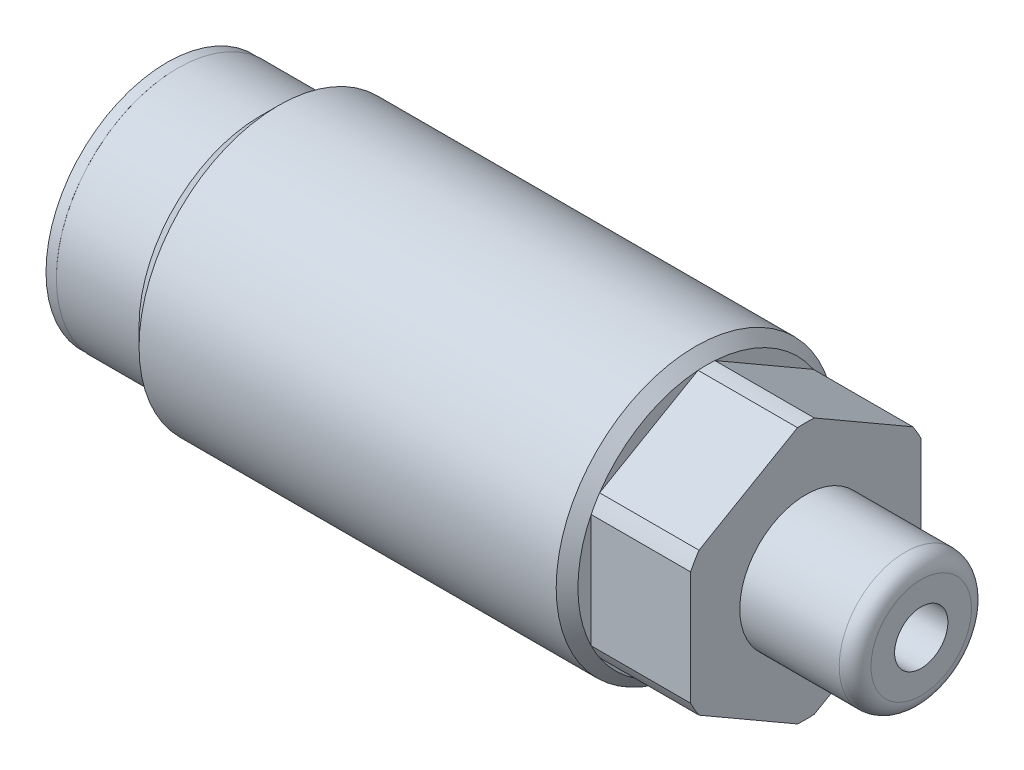
ISO-10303-21;
HEADER;
FILE_DESCRIPTION(('STEP AP214'),'2;1');
FILE_NAME('part.step','',(''),(''),'','','');
FILE_SCHEMA(('AUTOMOTIVE_DESIGN { 1 0 10303 214 1 1 1 1 }'));
ENDSEC;
DATA;
#1=APPLICATION_CONTEXT('core data for automotive mechanical design processes');
#2=APPLICATION_PROTOCOL_DEFINITION('international standard','automotive_design',2000,#1);
#3=PRODUCT_CONTEXT('',#1,'mechanical');
#4=PRODUCT('Part','Part','',(#3));
#5=PRODUCT_RELATED_PRODUCT_CATEGORY('part','',(#4));
#6=PRODUCT_DEFINITION_FORMATION('','',#4);
#7=PRODUCT_DEFINITION_CONTEXT('part definition',#1,'design');
#8=PRODUCT_DEFINITION('design','',#6,#7);
#9=PRODUCT_DEFINITION_SHAPE('','',#8);
#10=(LENGTH_UNIT() NAMED_UNIT(*) SI_UNIT(.MILLI.,.METRE.));
#11=(NAMED_UNIT(*) PLANE_ANGLE_UNIT() SI_UNIT($,.RADIAN.));
#12=(NAMED_UNIT(*) SI_UNIT($,.STERADIAN.) SOLID_ANGLE_UNIT());
#13=UNCERTAINTY_MEASURE_WITH_UNIT(LENGTH_MEASURE(1.E-05),#10,'distance_accuracy_value','');
#14=(GEOMETRIC_REPRESENTATION_CONTEXT(3) GLOBAL_UNCERTAINTY_ASSIGNED_CONTEXT((#13)) GLOBAL_UNIT_ASSIGNED_CONTEXT((#10,
#11,#12)) REPRESENTATION_CONTEXT('',''));
#15=CARTESIAN_POINT('',(0.,0.,0.));
#16=DIRECTION('',(0.,0.,1.));
#17=DIRECTION('',(1.,0.,0.));
#18=AXIS2_PLACEMENT_3D('',#15,#16,#17);
#19=CARTESIAN_POINT('',(71.247,0.,0.));
#20=DIRECTION('',(-1.,0.,0.));
#21=DIRECTION('',(0.,-1.,0.));
#22=AXIS2_PLACEMENT_3D('',#19,#20,#21);
#23=PLANE('',#22);
#24=CARTESIAN_POINT('',(71.247,0.,0.));
#25=DIRECTION('',(-1.,0.,0.));
#26=DIRECTION('',(0.,-1.,0.));
#27=AXIS2_PLACEMENT_3D('',#24,#25,#26);
#28=CIRCLE('',#27,4.8133);
#29=CARTESIAN_POINT('',(71.247,-4.8133,0.));
#30=VERTEX_POINT('',#29);
#31=EDGE_CURVE('E12',#30,#30,#28,.F.);
#32=ORIENTED_EDGE('',*,*,#31,.T.);
#33=EDGE_LOOP('',(#32));
#34=FACE_BOUND('',#33,.T.);
#35=CARTESIAN_POINT('',(71.247,0.,0.));
#36=DIRECTION('',(-1.,0.,0.));
#37=DIRECTION('',(0.,0.,1.));
#38=AXIS2_PLACEMENT_3D('',#35,#36,#37);
#39=CIRCLE('',#38,2.5527);
#40=CARTESIAN_POINT('',(71.247,0.,2.5527));
#41=VERTEX_POINT('',#40);
#42=EDGE_CURVE('E141',#41,#41,#39,.T.);
#43=ORIENTED_EDGE('',*,*,#42,.T.);
#44=EDGE_LOOP('',(#43));
#45=FACE_BOUND('',#44,.T.);
#46=ADVANCED_FACE('F41',(#34,#45),#23,.F.);
#47=CARTESIAN_POINT('',(50.673,13.3604,0.));
#48=DIRECTION('',(1.,0.,0.));
#49=DIRECTION('',(0.,0.,-1.));
#50=AXIS2_PLACEMENT_3D('',#47,#48,#49);
#51=PLANE('',#50);
#52=DIRECTION('',(0.,-0.5,-0.866025403784439));
#53=VECTOR('',#52,1.);
#54=CARTESIAN_POINT('',(50.673,-6.37914312427618,11.049));
#55=LINE('',#54,#53);
#56=CARTESIAN_POINT('',(50.673,-6.84486814154431,10.2423406077357));
#57=VERTEX_POINT('',#56);
#58=CARTESIAN_POINT('',(50.673,-12.2925612312842,0.806659392264294));
#59=VERTEX_POINT('',#58);
#60=EDGE_CURVE('E221',#57,#59,#55,.T.);
#61=ORIENTED_EDGE('',*,*,#60,.F.);
#62=CARTESIAN_POINT('',(50.673,0.,0.));
#63=DIRECTION('',(1.,0.,0.));
#64=DIRECTION('',(0.,0.,-1.));
#65=AXIS2_PLACEMENT_3D('',#62,#63,#64);
#66=CIRCLE('',#65,12.319);
#67=EDGE_CURVE('E250',#57,#59,#66,.T.);
#68=ORIENTED_EDGE('',*,*,#67,.T.);
#69=EDGE_LOOP('',(#61,#68));
#70=FACE_BOUND('',#69,.T.);
#71=ADVANCED_FACE('F269',(#70),#51,.T.);
#72=DIRECTION('',(0.,0.5,-0.866025403784439));
#73=VECTOR('',#72,1.);
#74=CARTESIAN_POINT('',(50.673,-12.7582862485524,0.));
#75=LINE('',#74,#73);
#76=CARTESIAN_POINT('',(50.673,-12.2925612312842,-0.806659392264294));
#77=VERTEX_POINT('',#76);
#78=CARTESIAN_POINT('',(50.673,-6.84486814154431,-10.2423406077357));
#79=VERTEX_POINT('',#78);
#80=EDGE_CURVE('E194',#77,#79,#75,.T.);
#81=ORIENTED_EDGE('',*,*,#80,.F.);
#82=CARTESIAN_POINT('',(50.673,0.,0.));
#83=DIRECTION('',(1.,0.,0.));
#84=DIRECTION('',(0.,0.,-1.));
#85=AXIS2_PLACEMENT_3D('',#82,#83,#84);
#86=CIRCLE('',#85,12.319);
#87=EDGE_CURVE('E55',#77,#79,#86,.T.);
#88=ORIENTED_EDGE('',*,*,#87,.T.);
#89=EDGE_LOOP('',(#81,#88));
#90=FACE_BOUND('',#89,.T.);
#91=ADVANCED_FACE('F275',(#90),#51,.T.);
#92=DIRECTION('',(0.,1.,0.));
#93=VECTOR('',#92,1.);
#94=CARTESIAN_POINT('',(50.673,-6.37914312427618,-11.049));
#95=LINE('',#94,#93);
#96=CARTESIAN_POINT('',(50.673,-5.44769308973991,-11.049));
#97=VERTEX_POINT('',#96);
#98=CARTESIAN_POINT('',(50.673,5.44769308973991,-11.049));
#99=VERTEX_POINT('',#98);
#100=EDGE_CURVE('E189',#97,#99,#95,.T.);
#101=ORIENTED_EDGE('',*,*,#100,.F.);
#102=CARTESIAN_POINT('',(50.673,0.,0.));
#103=DIRECTION('',(1.,0.,0.));
#104=DIRECTION('',(0.,0.,-1.));
#105=AXIS2_PLACEMENT_3D('',#102,#103,#104);
#106=CIRCLE('',#105,12.319);
#107=EDGE_CURVE('E247',#97,#99,#106,.T.);
#108=ORIENTED_EDGE('',*,*,#107,.T.);
#109=EDGE_LOOP('',(#101,#108));
#110=FACE_BOUND('',#109,.T.);
#111=ADVANCED_FACE('F460',(#110),#51,.T.);
#112=DIRECTION('',(0.,0.5,0.866025403784439));
#113=VECTOR('',#112,1.);
#114=CARTESIAN_POINT('',(50.673,6.37914312427617,-11.049));
#115=LINE('',#114,#113);
#116=CARTESIAN_POINT('',(50.673,6.8448681415443,-10.2423406077357));
#117=VERTEX_POINT('',#116);
#118=CARTESIAN_POINT('',(50.673,12.2925612312842,-0.806659392264296));
#119=VERTEX_POINT('',#118);
#120=EDGE_CURVE('E212',#117,#119,#115,.T.);
#121=ORIENTED_EDGE('',*,*,#120,.F.);
#122=CARTESIAN_POINT('',(50.673,0.,0.));
#123=DIRECTION('',(1.,0.,0.));
#124=DIRECTION('',(0.,0.,-1.));
#125=AXIS2_PLACEMENT_3D('',#122,#123,#124);
#126=CIRCLE('',#125,12.319);
#127=EDGE_CURVE('E245',#117,#119,#126,.T.);
#128=ORIENTED_EDGE('',*,*,#127,.T.);
#129=EDGE_LOOP('',(#121,#128));
#130=FACE_BOUND('',#129,.T.);
#131=ADVANCED_FACE('F469',(#130),#51,.T.);
#132=DIRECTION('',(0.,-0.5,0.866025403784439));
#133=VECTOR('',#132,1.);
#134=CARTESIAN_POINT('',(50.673,12.7582862485523,0.));
#135=LINE('',#134,#133);
#136=CARTESIAN_POINT('',(50.673,12.2925612312842,0.806659392264289));
#137=VERTEX_POINT('',#136);
#138=CARTESIAN_POINT('',(50.673,6.84486814154431,10.2423406077357));
#139=VERTEX_POINT('',#138);
#140=EDGE_CURVE('E215',#137,#139,#135,.T.);
#141=ORIENTED_EDGE('',*,*,#140,.F.);
#142=CARTESIAN_POINT('',(50.673,0.,0.));
#143=DIRECTION('',(1.,0.,0.));
#144=DIRECTION('',(0.,0.,-1.));
#145=AXIS2_PLACEMENT_3D('',#142,#143,#144);
#146=CIRCLE('',#145,12.319);
#147=EDGE_CURVE('E243',#137,#139,#146,.T.);
#148=ORIENTED_EDGE('',*,*,#147,.T.);
#149=EDGE_LOOP('',(#141,#148));
#150=FACE_BOUND('',#149,.T.);
#151=ADVANCED_FACE('F291',(#150),#51,.T.);
#152=CARTESIAN_POINT('',(60.198,19.1374293728285,-11.049));
#153=DIRECTION('',(1.,0.,0.));
#154=DIRECTION('',(0.,0.,-1.));
#155=AXIS2_PLACEMENT_3D('',#152,#153,#154);
#156=PLANE('',#155);
#157=CARTESIAN_POINT('',(60.198,0.,0.));
#158=DIRECTION('',(-1.,0.,0.));
#159=DIRECTION('',(0.,-1.,0.));
#160=AXIS2_PLACEMENT_3D('',#157,#158,#159);
#161=CIRCLE('',#160,6.3373);
#162=CARTESIAN_POINT('',(60.198,-6.3373,0.));
#163=VERTEX_POINT('',#162);
#164=EDGE_CURVE('E186',#163,#163,#161,.T.);
#165=ORIENTED_EDGE('',*,*,#164,.T.);
#166=EDGE_LOOP('',(#165));
#167=FACE_BOUND('',#166,.T.);
#168=DIRECTION('',(0.,1.,0.));
#169=VECTOR('',#168,1.);
#170=CARTESIAN_POINT('',(60.198,-6.37914312427618,-11.049));
#171=LINE('',#170,#169);
#172=CARTESIAN_POINT('',(60.198,-5.44769308973992,-11.049));
#173=VERTEX_POINT('',#172);
#174=CARTESIAN_POINT('',(60.198,5.44769308973992,-11.049));
#175=VERTEX_POINT('',#174);
#176=EDGE_CURVE('E190',#173,#175,#171,.T.);
#177=ORIENTED_EDGE('',*,*,#176,.T.);
#178=CARTESIAN_POINT('',(60.198,0.,0.));
#179=DIRECTION('',(1.,0.,0.));
#180=DIRECTION('',(0.,0.,-1.));
#181=AXIS2_PLACEMENT_3D('',#178,#179,#180);
#182=CIRCLE('',#181,12.319);
#183=CARTESIAN_POINT('',(60.198,6.8448681415443,-10.2423406077357));
#184=VERTEX_POINT('',#183);
#185=EDGE_CURVE('E147',#175,#184,#182,.T.);
#186=ORIENTED_EDGE('',*,*,#185,.T.);
#187=DIRECTION('',(0.,0.5,0.866025403784439));
#188=VECTOR('',#187,1.);
#189=CARTESIAN_POINT('',(60.198,6.37914312427617,-11.049));
#190=LINE('',#189,#188);
#191=CARTESIAN_POINT('',(60.198,12.2925612312842,-0.806659392264294));
#192=VERTEX_POINT('',#191);
#193=EDGE_CURVE('E193',#184,#192,#190,.T.);
#194=ORIENTED_EDGE('',*,*,#193,.T.);
#195=CARTESIAN_POINT('',(60.198,12.2925612312842,0.806659392264289));
#196=VERTEX_POINT('',#195);
#197=EDGE_CURVE('E151',#192,#196,#182,.T.);
#198=ORIENTED_EDGE('',*,*,#197,.T.);
#199=DIRECTION('',(0.,-0.5,0.866025403784439));
#200=VECTOR('',#199,1.);
#201=CARTESIAN_POINT('',(60.198,12.7582862485523,0.));
#202=LINE('',#201,#200);
#203=CARTESIAN_POINT('',(60.198,6.84486814154431,10.2423406077357));
#204=VERTEX_POINT('',#203);
#205=EDGE_CURVE('E197',#196,#204,#202,.T.);
#206=ORIENTED_EDGE('',*,*,#205,.T.);
#207=CARTESIAN_POINT('',(60.198,5.44769308973992,11.049));
#208=VERTEX_POINT('',#207);
#209=EDGE_CURVE('E599',#204,#208,#182,.T.);
#210=ORIENTED_EDGE('',*,*,#209,.T.);
#211=DIRECTION('',(0.,-1.,0.));
#212=VECTOR('',#211,1.);
#213=CARTESIAN_POINT('',(60.198,6.37914312427618,11.049));
#214=LINE('',#213,#212);
#215=CARTESIAN_POINT('',(60.198,-5.44769308973992,11.049));
#216=VERTEX_POINT('',#215);
#217=EDGE_CURVE('E200',#208,#216,#214,.T.);
#218=ORIENTED_EDGE('',*,*,#217,.T.);
#219=CARTESIAN_POINT('',(60.198,-6.84486814154431,10.2423406077357));
#220=VERTEX_POINT('',#219);
#221=EDGE_CURVE('E597',#216,#220,#182,.T.);
#222=ORIENTED_EDGE('',*,*,#221,.T.);
#223=DIRECTION('',(0.,-0.5,-0.866025403784439));
#224=VECTOR('',#223,1.);
#225=CARTESIAN_POINT('',(60.198,-6.37914312427618,11.049));
#226=LINE('',#225,#224);
#227=CARTESIAN_POINT('',(60.198,-12.2925612312842,0.806659392264292));
#228=VERTEX_POINT('',#227);
#229=EDGE_CURVE('E203',#220,#228,#226,.T.);
#230=ORIENTED_EDGE('',*,*,#229,.T.);
#231=CARTESIAN_POINT('',(60.198,-12.2925612312842,-0.806659392264291));
#232=VERTEX_POINT('',#231);
#233=EDGE_CURVE('E596',#228,#232,#182,.T.);
#234=ORIENTED_EDGE('',*,*,#233,.T.);
#235=DIRECTION('',(0.,0.5,-0.866025403784439));
#236=VECTOR('',#235,1.);
#237=CARTESIAN_POINT('',(60.198,-12.7582862485524,0.));
#238=LINE('',#237,#236);
#239=CARTESIAN_POINT('',(60.198,-6.84486814154431,-10.2423406077357));
#240=VERTEX_POINT('',#239);
#241=EDGE_CURVE('E206',#232,#240,#238,.T.);
#242=ORIENTED_EDGE('',*,*,#241,.T.);
#243=EDGE_CURVE('E144',#240,#173,#182,.T.);
#244=ORIENTED_EDGE('',*,*,#243,.T.);
#245=EDGE_LOOP('',(#177,#186,#194,#198,#206,#210,#218,#222,#230,#234,#242,#244));
#246=FACE_BOUND('',#245,.T.);
#247=ADVANCED_FACE('F287',(#167,#246),#156,.T.);
#248=CARTESIAN_POINT('',(60.198,-6.37914312427618,-11.049));
#249=DIRECTION('',(0.,0.,1.));
#250=DIRECTION('',(1.,0.,0.));
#251=AXIS2_PLACEMENT_3D('',#248,#249,#250);
#252=PLANE('',#251);
#253=DIRECTION('',(1.,0.,0.));
#254=VECTOR('',#253,1.);
#255=CARTESIAN_POINT('',(12.884082242541,-5.44769308973992,-11.049));
#256=LINE('',#255,#254);
#257=EDGE_CURVE('E63',#97,#173,#256,.T.);
#258=ORIENTED_EDGE('',*,*,#257,.F.);
#259=ORIENTED_EDGE('',*,*,#100,.T.);
#260=DIRECTION('',(1.,0.,0.));
#261=VECTOR('',#260,1.);
#262=CARTESIAN_POINT('',(12.884082242541,5.44769308973992,-11.049));
#263=LINE('',#262,#261);
#264=EDGE_CURVE('E176',#175,#99,#263,.F.);
#265=ORIENTED_EDGE('',*,*,#264,.F.);
#266=ORIENTED_EDGE('',*,*,#176,.F.);
#267=EDGE_LOOP('',(#258,#259,#265,#266));
#268=FACE_BOUND('',#267,.T.);
#269=ADVANCED_FACE('F290',(#268),#252,.F.);
#270=CARTESIAN_POINT('',(60.198,6.37914312427617,-11.049));
#271=DIRECTION('',(0.,-0.866025403784439,0.5));
#272=DIRECTION('',(0.,-0.5,-0.866025403784439));
#273=AXIS2_PLACEMENT_3D('',#270,#271,#272);
#274=PLANE('',#273);
#275=DIRECTION('',(1.,0.,0.));
#276=VECTOR('',#275,1.);
#277=CARTESIAN_POINT('',(12.884082242541,6.8448681415443,-10.2423406077357));
#278=LINE('',#277,#276);
#279=EDGE_CURVE('E174',#117,#184,#278,.T.);
#280=ORIENTED_EDGE('',*,*,#279,.F.);
#281=ORIENTED_EDGE('',*,*,#120,.T.);
#282=DIRECTION('',(1.,0.,0.));
#283=VECTOR('',#282,1.);
#284=CARTESIAN_POINT('',(12.884082242541,12.2925612312842,-0.806659392264294));
#285=LINE('',#284,#283);
#286=EDGE_CURVE('E171',#192,#119,#285,.F.);
#287=ORIENTED_EDGE('',*,*,#286,.F.);
#288=ORIENTED_EDGE('',*,*,#193,.F.);
#289=EDGE_LOOP('',(#280,#281,#287,#288));
#290=FACE_BOUND('',#289,.T.);
#291=ADVANCED_FACE('F308',(#290),#274,.F.);
#292=CARTESIAN_POINT('',(60.198,12.7582862485523,0.));
#293=DIRECTION('',(0.,-0.866025403784439,-0.5));
#294=DIRECTION('',(0.,0.5,-0.866025403784439));
#295=AXIS2_PLACEMENT_3D('',#292,#293,#294);
#296=PLANE('',#295);
#297=DIRECTION('',(1.,0.,0.));
#298=VECTOR('',#297,1.);
#299=CARTESIAN_POINT('',(12.884082242541,12.2925612312842,0.806659392264289));
#300=LINE('',#299,#298);
#301=EDGE_CURVE('E169',#137,#196,#300,.T.);
#302=ORIENTED_EDGE('',*,*,#301,.F.);
#303=ORIENTED_EDGE('',*,*,#140,.T.);
#304=DIRECTION('',(1.,0.,0.));
#305=VECTOR('',#304,1.);
#306=CARTESIAN_POINT('',(12.884082242541,6.84486814154431,10.2423406077357));
#307=LINE('',#306,#305);
#308=EDGE_CURVE('E166',#204,#139,#307,.F.);
#309=ORIENTED_EDGE('',*,*,#308,.F.);
#310=ORIENTED_EDGE('',*,*,#205,.F.);
#311=EDGE_LOOP('',(#302,#303,#309,#310));
#312=FACE_BOUND('',#311,.T.);
#313=ADVANCED_FACE('F304',(#312),#296,.F.);
#314=CARTESIAN_POINT('',(60.198,6.37914312427618,11.049));
#315=DIRECTION('',(0.,0.,-1.));
#316=DIRECTION('',(-1.,0.,0.));
#317=AXIS2_PLACEMENT_3D('',#314,#315,#316);
#318=PLANE('',#317);
#319=DIRECTION('',(1.,0.,0.));
#320=VECTOR('',#319,1.);
#321=CARTESIAN_POINT('',(12.884082242541,5.44769308973992,11.049));
#322=LINE('',#321,#320);
#323=CARTESIAN_POINT('',(50.673,5.44769308973991,11.049));
#324=VERTEX_POINT('',#323);
#325=EDGE_CURVE('E164',#324,#208,#322,.T.);
#326=ORIENTED_EDGE('',*,*,#325,.F.);
#327=DIRECTION('',(0.,-1.,0.));
#328=VECTOR('',#327,1.);
#329=CARTESIAN_POINT('',(50.673,6.37914312427618,11.049));
#330=LINE('',#329,#328);
#331=CARTESIAN_POINT('',(50.673,-5.44769308973991,11.049));
#332=VERTEX_POINT('',#331);
#333=EDGE_CURVE('E218',#324,#332,#330,.T.);
#334=ORIENTED_EDGE('',*,*,#333,.T.);
#335=DIRECTION('',(1.,0.,0.));
#336=VECTOR('',#335,1.);
#337=CARTESIAN_POINT('',(12.884082242541,-5.44769308973992,11.049));
#338=LINE('',#337,#336);
#339=EDGE_CURVE('E161',#216,#332,#338,.F.);
#340=ORIENTED_EDGE('',*,*,#339,.F.);
#341=ORIENTED_EDGE('',*,*,#217,.F.);
#342=EDGE_LOOP('',(#326,#334,#340,#341));
#343=FACE_BOUND('',#342,.T.);
#344=ADVANCED_FACE('F300',(#343),#318,.F.);
#345=CARTESIAN_POINT('',(60.198,-6.37914312427618,11.049));
#346=DIRECTION('',(0.,0.866025403784439,-0.5));
#347=DIRECTION('',(0.,0.5,0.866025403784439));
#348=AXIS2_PLACEMENT_3D('',#345,#346,#347);
#349=PLANE('',#348);
#350=DIRECTION('',(1.,0.,0.));
#351=VECTOR('',#350,1.);
#352=CARTESIAN_POINT('',(12.884082242541,-6.8448681415443,10.2423406077357));
#353=LINE('',#352,#351);
#354=EDGE_CURVE('E159',#57,#220,#353,.T.);
#355=ORIENTED_EDGE('',*,*,#354,.F.);
#356=ORIENTED_EDGE('',*,*,#60,.T.);
#357=DIRECTION('',(1.,0.,0.));
#358=VECTOR('',#357,1.);
#359=CARTESIAN_POINT('',(12.884082242541,-12.2925612312842,0.806659392264292));
#360=LINE('',#359,#358);
#361=EDGE_CURVE('E155',#228,#59,#360,.F.);
#362=ORIENTED_EDGE('',*,*,#361,.F.);
#363=ORIENTED_EDGE('',*,*,#229,.F.);
#364=EDGE_LOOP('',(#355,#356,#362,#363));
#365=FACE_BOUND('',#364,.T.);
#366=ADVANCED_FACE('F296',(#365),#349,.F.);
#367=CARTESIAN_POINT('',(60.198,-12.7582862485524,0.));
#368=DIRECTION('',(0.,0.866025403784439,0.5));
#369=DIRECTION('',(0.,-0.5,0.866025403784439));
#370=AXIS2_PLACEMENT_3D('',#367,#368,#369);
#371=PLANE('',#370);
#372=DIRECTION('',(1.,0.,0.));
#373=VECTOR('',#372,1.);
#374=CARTESIAN_POINT('',(12.884082242541,-12.2925612312842,-0.806659392264291));
#375=LINE('',#374,#373);
#376=EDGE_CURVE('E236',#77,#232,#375,.T.);
#377=ORIENTED_EDGE('',*,*,#376,.F.);
#378=ORIENTED_EDGE('',*,*,#80,.T.);
#379=DIRECTION('',(1.,0.,0.));
#380=VECTOR('',#379,1.);
#381=CARTESIAN_POINT('',(12.884082242541,-6.84486814154431,-10.2423406077357));
#382=LINE('',#381,#380);
#383=EDGE_CURVE('E234',#240,#79,#382,.F.);
#384=ORIENTED_EDGE('',*,*,#383,.F.);
#385=ORIENTED_EDGE('',*,*,#241,.F.);
#386=EDGE_LOOP('',(#377,#378,#384,#385));
#387=FACE_BOUND('',#386,.T.);
#388=ADVANCED_FACE('F293',(#387),#371,.F.);
#389=ORIENTED_EDGE('',*,*,#333,.F.);
#390=CARTESIAN_POINT('',(50.673,0.,0.));
#391=DIRECTION('',(1.,0.,0.));
#392=DIRECTION('',(0.,0.,-1.));
#393=AXIS2_PLACEMENT_3D('',#390,#391,#392);
#394=CIRCLE('',#393,12.319);
#395=EDGE_CURVE('E241',#324,#332,#394,.T.);
#396=ORIENTED_EDGE('',*,*,#395,.T.);
#397=EDGE_LOOP('',(#389,#396));
#398=FACE_BOUND('',#397,.T.);
#399=ADVANCED_FACE('F278',(#398),#51,.T.);
#400=CARTESIAN_POINT('',(30.6025425410263,0.,0.));
#401=DIRECTION('',(-1.,0.,0.));
#402=DIRECTION('',(0.,0.,1.));
#403=AXIS2_PLACEMENT_3D('',#400,#401,#402);
#404=CYLINDRICAL_SURFACE('',#403,13.3604);
#405=CARTESIAN_POINT('',(49.6316,0.,0.));
#406=DIRECTION('',(1.,0.,0.));
#407=DIRECTION('',(0.,0.,-1.));
#408=AXIS2_PLACEMENT_3D('',#405,#406,#407);
#409=CIRCLE('',#408,13.3604);
#410=CARTESIAN_POINT('',(49.6316,0.,-13.3604));
#411=VERTEX_POINT('',#410);
#412=EDGE_CURVE('E238',#411,#411,#409,.F.);
#413=ORIENTED_EDGE('',*,*,#412,.T.);
#414=EDGE_LOOP('',(#413));
#415=FACE_BOUND('',#414,.T.);
#416=CARTESIAN_POINT('',(9.66469999999998,0.,0.));
#417=DIRECTION('',(-1.,0.,0.));
#418=DIRECTION('',(0.,0.,1.));
#419=AXIS2_PLACEMENT_3D('',#416,#417,#418);
#420=CIRCLE('',#419,13.3604);
#421=CARTESIAN_POINT('',(9.66469999999998,0.,13.3604));
#422=VERTEX_POINT('',#421);
#423=EDGE_CURVE('E209',#422,#422,#420,.T.);
#424=ORIENTED_EDGE('',*,*,#423,.F.);
#425=EDGE_LOOP('',(#424));
#426=FACE_BOUND('',#425,.T.);
#427=ADVANCED_FACE('F325',(#415,#426),#404,.T.);
#428=CARTESIAN_POINT('',(0.,0.,0.));
#429=DIRECTION('',(-1.,0.,0.));
#430=DIRECTION('',(0.,0.,1.));
#431=AXIS2_PLACEMENT_3D('',#428,#429,#430);
#432=PLANE('',#431);
#433=CARTESIAN_POINT('',(0.,0.,0.));
#434=DIRECTION('',(-1.,0.,0.));
#435=DIRECTION('',(0.,0.,1.));
#436=AXIS2_PLACEMENT_3D('',#433,#434,#435);
#437=CIRCLE('',#436,6.73100000000001);
#438=CARTESIAN_POINT('',(0.,0.,6.73100000000001));
#439=VERTEX_POINT('',#438);
#440=EDGE_CURVE('E180',#439,#439,#437,.T.);
#441=ORIENTED_EDGE('',*,*,#440,.F.);
#442=EDGE_LOOP('',(#441));
#443=FACE_BOUND('',#442,.T.);
#444=CARTESIAN_POINT('',(0.,0.,0.));
#445=DIRECTION('',(-1.,0.,0.));
#446=DIRECTION('',(0.,0.,1.));
#447=AXIS2_PLACEMENT_3D('',#444,#445,#446);
#448=CIRCLE('',#447,11.6205);
#449=CARTESIAN_POINT('',(0.,0.,11.6205));
#450=VERTEX_POINT('',#449);
#451=EDGE_CURVE('E231',#450,#450,#448,.T.);
#452=ORIENTED_EDGE('',*,*,#451,.T.);
#453=EDGE_LOOP('',(#452));
#454=FACE_BOUND('',#453,.T.);
#455=ADVANCED_FACE('F322',(#443,#454),#432,.T.);
#456=CARTESIAN_POINT('',(30.6025425410263,0.,0.));
#457=DIRECTION('',(-1.,0.,0.));
#458=DIRECTION('',(0.,0.,1.));
#459=AXIS2_PLACEMENT_3D('',#456,#457,#458);
#460=CYLINDRICAL_SURFACE('',#459,11.6205);
#461=CARTESIAN_POINT('',(7.9248,0.,0.));
#462=DIRECTION('',(-1.,0.,0.));
#463=DIRECTION('',(0.,0.,1.));
#464=AXIS2_PLACEMENT_3D('',#461,#462,#463);
#465=CIRCLE('',#464,11.6205);
#466=CARTESIAN_POINT('',(7.9248,0.,11.6205));
#467=VERTEX_POINT('',#466);
#468=EDGE_CURVE('E228',#467,#467,#465,.T.);
#469=ORIENTED_EDGE('',*,*,#468,.T.);
#470=EDGE_LOOP('',(#469));
#471=FACE_BOUND('',#470,.T.);
#472=ORIENTED_EDGE('',*,*,#451,.F.);
#473=EDGE_LOOP('',(#472));
#474=FACE_BOUND('',#473,.T.);
#475=ADVANCED_FACE('F318',(#471,#474),#460,.T.);
#476=CARTESIAN_POINT('',(7.9248,0.,0.));
#477=DIRECTION('',(1.,0.,0.));
#478=DIRECTION('',(0.,0.,-1.));
#479=AXIS2_PLACEMENT_3D('',#476,#477,#478);
#480=CONICAL_SURFACE('',#479,11.6205,0.785398163397452);
#481=ORIENTED_EDGE('',*,*,#423,.T.);
#482=EDGE_LOOP('',(#481));
#483=FACE_BOUND('',#482,.T.);
#484=ORIENTED_EDGE('',*,*,#468,.F.);
#485=EDGE_LOOP('',(#484));
#486=FACE_BOUND('',#485,.T.);
#487=ADVANCED_FACE('F286',(#483,#486),#480,.T.);
#488=CARTESIAN_POINT('',(60.198,0.,0.));
#489=DIRECTION('',(-1.,0.,0.));
#490=DIRECTION('',(0.,-1.,0.));
#491=AXIS2_PLACEMENT_3D('',#488,#489,#490);
#492=CYLINDRICAL_SURFACE('',#491,6.3373);
#493=CARTESIAN_POINT('',(69.723,0.,0.));
#494=DIRECTION('',(-1.,0.,0.));
#495=DIRECTION('',(0.,-1.,0.));
#496=AXIS2_PLACEMENT_3D('',#493,#494,#495);
#497=CIRCLE('',#496,6.3373);
#498=CARTESIAN_POINT('',(69.723,-6.3373,0.));
#499=VERTEX_POINT('',#498);
#500=EDGE_CURVE('E49',#499,#499,#497,.T.);
#501=ORIENTED_EDGE('',*,*,#500,.T.);
#502=EDGE_LOOP('',(#501));
#503=FACE_BOUND('',#502,.T.);
#504=ORIENTED_EDGE('',*,*,#164,.F.);
#505=EDGE_LOOP('',(#504));
#506=FACE_BOUND('',#505,.T.);
#507=ADVANCED_FACE('F254',(#503,#506),#492,.T.);
#508=CARTESIAN_POINT('',(1.016,0.,0.));
#509=DIRECTION('',(1.,0.,0.));
#510=DIRECTION('',(0.,0.,-1.));
#511=AXIS2_PLACEMENT_3D('',#508,#509,#510);
#512=PLANE('',#511);
#513=CARTESIAN_POINT('',(1.016,0.,0.));
#514=DIRECTION('',(-1.,0.,0.));
#515=DIRECTION('',(0.,0.,1.));
#516=AXIS2_PLACEMENT_3D('',#513,#514,#515);
#517=CIRCLE('',#516,6.73100000000001);
#518=CARTESIAN_POINT('',(1.016,0.,6.73100000000001));
#519=VERTEX_POINT('',#518);
#520=EDGE_CURVE('E183',#519,#519,#517,.T.);
#521=ORIENTED_EDGE('',*,*,#520,.T.);
#522=EDGE_LOOP('',(#521));
#523=FACE_BOUND('',#522,.T.);
#524=ADVANCED_FACE('F282',(#523),#512,.F.);
#525=CARTESIAN_POINT('',(0.,0.,0.));
#526=DIRECTION('',(-1.,0.,0.));
#527=DIRECTION('',(0.,0.,1.));
#528=AXIS2_PLACEMENT_3D('',#525,#526,#527);
#529=CYLINDRICAL_SURFACE('',#528,6.73100000000001);
#530=ORIENTED_EDGE('',*,*,#520,.F.);
#531=EDGE_LOOP('',(#530));
#532=FACE_BOUND('',#531,.T.);
#533=ORIENTED_EDGE('',*,*,#440,.T.);
#534=EDGE_LOOP('',(#533));
#535=FACE_BOUND('',#534,.T.);
#536=ADVANCED_FACE('F369',(#532,#535),#529,.F.);
#537=CARTESIAN_POINT('',(12.884082242541,0.,0.));
#538=DIRECTION('',(1.,0.,0.));
#539=DIRECTION('',(0.,0.,-1.));
#540=AXIS2_PLACEMENT_3D('',#537,#538,#539);
#541=CYLINDRICAL_SURFACE('',#540,12.319);
#542=ORIENTED_EDGE('',*,*,#257,.T.);
#543=ORIENTED_EDGE('',*,*,#243,.F.);
#544=ORIENTED_EDGE('',*,*,#383,.T.);
#545=CARTESIAN_POINT('',(50.673,0.,0.));
#546=DIRECTION('',(1.,0.,0.));
#547=DIRECTION('',(0.,0.,-1.));
#548=AXIS2_PLACEMENT_3D('',#545,#546,#547);
#549=CIRCLE('',#548,12.319);
#550=EDGE_CURVE('E152',#97,#79,#549,.F.);
#551=ORIENTED_EDGE('',*,*,#550,.F.);
#552=EDGE_LOOP('',(#542,#543,#544,#551));
#553=FACE_BOUND('',#552,.T.);
#554=ADVANCED_FACE('F376',(#553),#541,.T.);
#555=ORIENTED_EDGE('',*,*,#361,.T.);
#556=EDGE_CURVE('E156',#77,#59,#549,.F.);
#557=ORIENTED_EDGE('',*,*,#556,.F.);
#558=ORIENTED_EDGE('',*,*,#376,.T.);
#559=ORIENTED_EDGE('',*,*,#233,.F.);
#560=EDGE_LOOP('',(#555,#557,#558,#559));
#561=FACE_BOUND('',#560,.T.);
#562=ADVANCED_FACE('F383',(#561),#541,.T.);
#563=ORIENTED_EDGE('',*,*,#339,.T.);
#564=EDGE_CURVE('E580',#57,#332,#549,.F.);
#565=ORIENTED_EDGE('',*,*,#564,.F.);
#566=ORIENTED_EDGE('',*,*,#354,.T.);
#567=ORIENTED_EDGE('',*,*,#221,.F.);
#568=EDGE_LOOP('',(#563,#565,#566,#567));
#569=FACE_BOUND('',#568,.T.);
#570=ADVANCED_FACE('F390',(#569),#541,.T.);
#571=ORIENTED_EDGE('',*,*,#308,.T.);
#572=EDGE_CURVE('E577',#324,#139,#549,.F.);
#573=ORIENTED_EDGE('',*,*,#572,.F.);
#574=ORIENTED_EDGE('',*,*,#325,.T.);
#575=ORIENTED_EDGE('',*,*,#209,.F.);
#576=EDGE_LOOP('',(#571,#573,#574,#575));
#577=FACE_BOUND('',#576,.T.);
#578=ADVANCED_FACE('F397',(#577),#541,.T.);
#579=ORIENTED_EDGE('',*,*,#286,.T.);
#580=EDGE_CURVE('E575',#137,#119,#549,.F.);
#581=ORIENTED_EDGE('',*,*,#580,.F.);
#582=ORIENTED_EDGE('',*,*,#301,.T.);
#583=ORIENTED_EDGE('',*,*,#197,.F.);
#584=EDGE_LOOP('',(#579,#581,#582,#583));
#585=FACE_BOUND('',#584,.T.);
#586=ADVANCED_FACE('F404',(#585),#541,.T.);
#587=ORIENTED_EDGE('',*,*,#264,.T.);
#588=EDGE_CURVE('E150',#117,#99,#549,.F.);
#589=ORIENTED_EDGE('',*,*,#588,.F.);
#590=ORIENTED_EDGE('',*,*,#279,.T.);
#591=ORIENTED_EDGE('',*,*,#185,.F.);
#592=EDGE_LOOP('',(#587,#589,#590,#591));
#593=FACE_BOUND('',#592,.T.);
#594=ADVANCED_FACE('F265',(#593),#541,.T.);
#595=CARTESIAN_POINT('',(49.6316,0.,0.));
#596=DIRECTION('',(-1.,0.,0.));
#597=DIRECTION('',(0.,0.,1.));
#598=AXIS2_PLACEMENT_3D('',#595,#596,#597);
#599=CONICAL_SURFACE('',#598,13.3604,0.785398163397457);
#600=ORIENTED_EDGE('',*,*,#67,.F.);
#601=ORIENTED_EDGE('',*,*,#564,.T.);
#602=ORIENTED_EDGE('',*,*,#395,.F.);
#603=ORIENTED_EDGE('',*,*,#572,.T.);
#604=ORIENTED_EDGE('',*,*,#147,.F.);
#605=ORIENTED_EDGE('',*,*,#580,.T.);
#606=ORIENTED_EDGE('',*,*,#127,.F.);
#607=ORIENTED_EDGE('',*,*,#588,.T.);
#608=ORIENTED_EDGE('',*,*,#107,.F.);
#609=ORIENTED_EDGE('',*,*,#550,.T.);
#610=ORIENTED_EDGE('',*,*,#87,.F.);
#611=ORIENTED_EDGE('',*,*,#556,.T.);
#612=EDGE_LOOP('',(#600,#601,#602,#603,#604,#605,#606,#607,#608,#609,#610,#611));
#613=FACE_BOUND('',#612,.T.);
#614=ORIENTED_EDGE('',*,*,#412,.F.);
#615=EDGE_LOOP('',(#614));
#616=FACE_BOUND('',#615,.T.);
#617=ADVANCED_FACE('F258',(#613,#616),#599,.T.);
#618=CARTESIAN_POINT('',(69.723,0.,0.));
#619=DIRECTION('',(-1.,0.,0.));
#620=DIRECTION('',(0.,-1.,0.));
#621=AXIS2_PLACEMENT_3D('',#618,#619,#620);
#622=TOROIDAL_SURFACE('',#621,4.8133,1.524);
#623=ORIENTED_EDGE('',*,*,#31,.F.);
#624=EDGE_LOOP('',(#623));
#625=FACE_BOUND('',#624,.T.);
#626=ORIENTED_EDGE('',*,*,#500,.F.);
#627=EDGE_LOOP('',(#626));
#628=FACE_BOUND('',#627,.T.);
#629=ADVANCED_FACE('F43',(#625,#628),#622,.T.);
#630=CARTESIAN_POINT('',(0.,0.,0.));
#631=DIRECTION('',(-1.,0.,0.));
#632=DIRECTION('',(0.,0.,1.));
#633=AXIS2_PLACEMENT_3D('',#630,#631,#632);
#634=CYLINDRICAL_SURFACE('',#633,2.5527);
#635=CARTESIAN_POINT('',(56.7788169021917,0.,0.));
#636=DIRECTION('',(-1.,0.,0.));
#637=DIRECTION('',(0.,0.,1.));
#638=AXIS2_PLACEMENT_3D('',#635,#636,#637);
#639=CIRCLE('',#638,2.5527);
#640=CARTESIAN_POINT('',(56.7788169021917,0.,2.5527));
#641=VERTEX_POINT('',#640);
#642=EDGE_CURVE('E139',#641,#641,#639,.T.);
#643=ORIENTED_EDGE('',*,*,#642,.T.);
#644=EDGE_LOOP('',(#643));
#645=FACE_BOUND('',#644,.T.);
#646=ORIENTED_EDGE('',*,*,#42,.F.);
#647=EDGE_LOOP('',(#646));
#648=FACE_BOUND('',#647,.T.);
#649=ADVANCED_FACE('F135',(#645,#648),#634,.F.);
#650=CARTESIAN_POINT('',(56.7788169021917,0.,0.));
#651=DIRECTION('',(1.,0.,0.));
#652=DIRECTION('',(0.,0.,-1.));
#653=AXIS2_PLACEMENT_3D('',#650,#651,#652);
#654=CONICAL_SURFACE('',#653,2.5527,1.02974425867665);
#655=CARTESIAN_POINT('',(55.245,0.,0.));
#656=VERTEX_POINT('',#655);
#657=VERTEX_LOOP('',#656);
#658=FACE_BOUND('',#657,.T.);
#659=ORIENTED_EDGE('',*,*,#642,.F.);
#660=EDGE_LOOP('',(#659));
#661=FACE_BOUND('',#660,.T.);
#662=ADVANCED_FACE('F132',(#658,#661),#654,.F.);
#663=CLOSED_SHELL('',(#46,#71,#91,#111,#131,#151,#247,#269,#291,#313,#344,#366,#388,#399,#427,
#455,#475,#487,#507,#524,#536,#554,#562,#570,#578,#586,#594,#617,#629,#649,#662));
#664=MANIFOLD_SOLID_BREP('B2',#663);
#665=CARTESIAN_POINT('',(-0.0254000000000045,9.5885,0.));
#666=DIRECTION('',(1.,0.,0.));
#667=DIRECTION('',(0.,0.,-1.));
#668=AXIS2_PLACEMENT_3D('',#665,#666,#667);
#669=PLANE('',#668);
#670=CARTESIAN_POINT('',(-0.0254000000000048,0.,0.));
#671=DIRECTION('',(1.,0.,0.));
#672=DIRECTION('',(0.,0.,-1.));
#673=AXIS2_PLACEMENT_3D('',#670,#671,#672);
#674=CIRCLE('',#673,11.5951);
#675=CARTESIAN_POINT('',(-0.0254000000000048,0.,-11.5951));
#676=VERTEX_POINT('',#675);
#677=EDGE_CURVE('E40',#676,#676,#674,.T.);
#678=ORIENTED_EDGE('',*,*,#677,.T.);
#679=EDGE_LOOP('',(#678));
#680=FACE_BOUND('',#679,.T.);
#681=CARTESIAN_POINT('',(-0.025400000000004,0.,0.));
#682=DIRECTION('',(1.,0.,0.));
#683=DIRECTION('',(0.,0.,-1.));
#684=AXIS2_PLACEMENT_3D('',#681,#682,#683);
#685=CIRCLE('',#684,9.5885);
#686=CARTESIAN_POINT('',(-0.025400000000004,0.,-9.5885));
#687=VERTEX_POINT('',#686);
#688=EDGE_CURVE('E638',#687,#687,#685,.T.);
#689=ORIENTED_EDGE('',*,*,#688,.F.);
#690=EDGE_LOOP('',(#689));
#691=FACE_BOUND('',#690,.T.);
#692=ADVANCED_FACE('F624',(#680,#691),#669,.T.);
#693=CARTESIAN_POINT('',(-0.762,0.,0.));
#694=DIRECTION('',(1.,0.,0.));
#695=DIRECTION('',(0.,0.,-1.));
#696=AXIS2_PLACEMENT_3D('',#693,#694,#695);
#697=CYLINDRICAL_SURFACE('',#696,11.5951);
#698=CARTESIAN_POINT('',(-1.016,0.,0.));
#699=DIRECTION('',(1.,0.,0.));
#700=DIRECTION('',(0.,0.,-1.));
#701=AXIS2_PLACEMENT_3D('',#698,#699,#700);
#702=CIRCLE('',#701,11.5951);
#703=CARTESIAN_POINT('',(-1.016,0.,-11.5951));
#704=VERTEX_POINT('',#703);
#705=EDGE_CURVE('E630',#704,#704,#702,.T.);
#706=ORIENTED_EDGE('',*,*,#705,.T.);
#707=EDGE_LOOP('',(#706));
#708=FACE_BOUND('',#707,.T.);
#709=ORIENTED_EDGE('',*,*,#677,.F.);
#710=EDGE_LOOP('',(#709));
#711=FACE_BOUND('',#710,.T.);
#712=ADVANCED_FACE('F648',(#708,#711),#697,.T.);
#713=CARTESIAN_POINT('',(-1.016,11.5951,0.));
#714=DIRECTION('',(-1.,0.,0.));
#715=DIRECTION('',(0.,0.,1.));
#716=AXIS2_PLACEMENT_3D('',#713,#714,#715);
#717=PLANE('',#716);
#718=CARTESIAN_POINT('',(-1.016,0.,0.));
#719=DIRECTION('',(1.,0.,0.));
#720=DIRECTION('',(0.,0.,-1.));
#721=AXIS2_PLACEMENT_3D('',#718,#719,#720);
#722=CIRCLE('',#721,9.5885);
#723=CARTESIAN_POINT('',(-1.016,0.,-9.5885));
#724=VERTEX_POINT('',#723);
#725=EDGE_CURVE('E634',#724,#724,#722,.T.);
#726=ORIENTED_EDGE('',*,*,#725,.T.);
#727=EDGE_LOOP('',(#726));
#728=FACE_BOUND('',#727,.T.);
#729=ORIENTED_EDGE('',*,*,#705,.F.);
#730=EDGE_LOOP('',(#729));
#731=FACE_BOUND('',#730,.T.);
#732=ADVANCED_FACE('F652',(#728,#731),#717,.T.);
#733=CARTESIAN_POINT('',(-0.762,0.,0.));
#734=DIRECTION('',(1.,0.,0.));
#735=DIRECTION('',(0.,0.,-1.));
#736=AXIS2_PLACEMENT_3D('',#733,#734,#735);
#737=CYLINDRICAL_SURFACE('',#736,9.5885);
#738=ORIENTED_EDGE('',*,*,#688,.T.);
#739=EDGE_LOOP('',(#738));
#740=FACE_BOUND('',#739,.T.);
#741=ORIENTED_EDGE('',*,*,#725,.F.);
#742=EDGE_LOOP('',(#741));
#743=FACE_BOUND('',#742,.T.);
#744=ADVANCED_FACE('F644',(#740,#743),#737,.F.);
#745=CLOSED_SHELL('',(#692,#712,#732,#744));
#746=MANIFOLD_SOLID_BREP('B6',#745);
#747=ADVANCED_BREP_SHAPE_REPRESENTATION('',(#18,#664,#746),#14);
#748=SHAPE_DEFINITION_REPRESENTATION(#9,#747);
ENDSEC;
END-ISO-10303-21;
